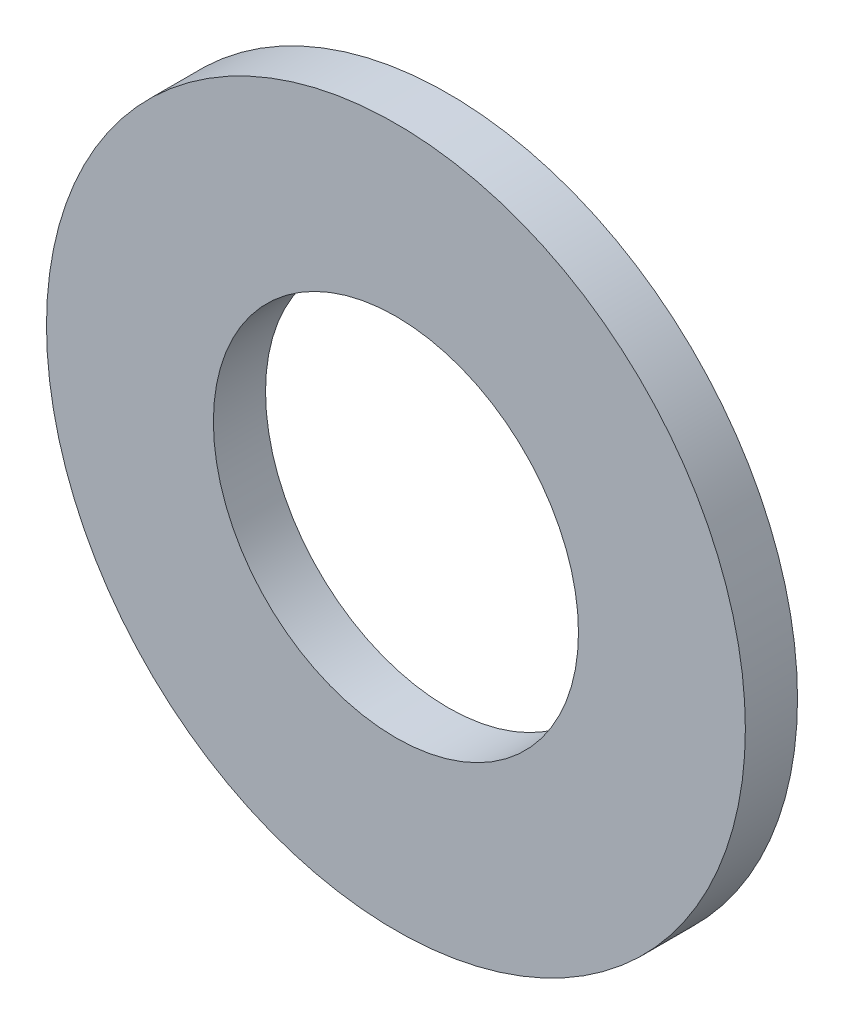
ISO-10303-21;
HEADER;
FILE_DESCRIPTION(('STEP AP214'),'2;1');
FILE_NAME('part.step','',(''),(''),'','','');
FILE_SCHEMA(('AUTOMOTIVE_DESIGN { 1 0 10303 214 1 1 1 1 }'));
ENDSEC;
DATA;
#1=APPLICATION_CONTEXT('core data for automotive mechanical design processes');
#2=APPLICATION_PROTOCOL_DEFINITION('international standard','automotive_design',2000,#1);
#3=PRODUCT_CONTEXT('',#1,'mechanical');
#4=PRODUCT('Part','Part','',(#3));
#5=PRODUCT_RELATED_PRODUCT_CATEGORY('part','',(#4));
#6=PRODUCT_DEFINITION_FORMATION('','',#4);
#7=PRODUCT_DEFINITION_CONTEXT('part definition',#1,'design');
#8=PRODUCT_DEFINITION('design','',#6,#7);
#9=PRODUCT_DEFINITION_SHAPE('','',#8);
#10=(LENGTH_UNIT() NAMED_UNIT(*) SI_UNIT(.MILLI.,.METRE.));
#11=(NAMED_UNIT(*) PLANE_ANGLE_UNIT() SI_UNIT($,.RADIAN.));
#12=(NAMED_UNIT(*) SI_UNIT($,.STERADIAN.) SOLID_ANGLE_UNIT());
#13=UNCERTAINTY_MEASURE_WITH_UNIT(LENGTH_MEASURE(1.E-05),#10,'distance_accuracy_value','');
#14=(GEOMETRIC_REPRESENTATION_CONTEXT(3) GLOBAL_UNCERTAINTY_ASSIGNED_CONTEXT((#13)) GLOBAL_UNIT_ASSIGNED_CONTEXT((#10,
#11,#12)) REPRESENTATION_CONTEXT('',''));
#15=CARTESIAN_POINT('',(0.,0.,0.));
#16=DIRECTION('',(0.,0.,1.));
#17=DIRECTION('',(1.,0.,0.));
#18=AXIS2_PLACEMENT_3D('',#15,#16,#17);
#19=CARTESIAN_POINT('',(0.,0.,0.));
#20=DIRECTION('',(0.,0.,1.));
#21=DIRECTION('',(1.,0.,0.));
#22=AXIS2_PLACEMENT_3D('',#19,#20,#21);
#23=PLANE('',#22);
#24=CARTESIAN_POINT('',(0.,0.,0.));
#25=DIRECTION('',(0.,0.,1.));
#26=DIRECTION('',(1.,0.,0.));
#27=AXIS2_PLACEMENT_3D('',#24,#25,#26);
#28=CIRCLE('',#27,1.75);
#29=CARTESIAN_POINT('',(1.75,0.,0.));
#30=VERTEX_POINT('',#29);
#31=EDGE_CURVE('E26',#30,#30,#28,.T.);
#32=ORIENTED_EDGE('',*,*,#31,.T.);
#33=EDGE_LOOP('',(#32));
#34=FACE_BOUND('',#33,.T.);
#35=CARTESIAN_POINT('',(0.,0.,0.));
#36=DIRECTION('',(0.,0.,1.));
#37=DIRECTION('',(1.,0.,0.));
#38=AXIS2_PLACEMENT_3D('',#35,#36,#37);
#39=CIRCLE('',#38,3.35);
#40=CARTESIAN_POINT('',(3.35,0.,0.));
#41=VERTEX_POINT('',#40);
#42=EDGE_CURVE('E17',#41,#41,#39,.T.);
#43=ORIENTED_EDGE('',*,*,#42,.F.);
#44=EDGE_LOOP('',(#43));
#45=FACE_BOUND('',#44,.T.);
#46=ADVANCED_FACE('F14',(#34,#45),#23,.F.);
#47=CARTESIAN_POINT('',(0.,0.,0.));
#48=DIRECTION('',(0.,0.,1.));
#49=DIRECTION('',(1.,0.,0.));
#50=AXIS2_PLACEMENT_3D('',#47,#48,#49);
#51=CYLINDRICAL_SURFACE('',#50,3.35);
#52=ORIENTED_EDGE('',*,*,#42,.T.);
#53=EDGE_LOOP('',(#52));
#54=FACE_BOUND('',#53,.T.);
#55=CARTESIAN_POINT('',(0.,0.,0.5));
#56=DIRECTION('',(0.,0.,1.));
#57=DIRECTION('',(1.,0.,0.));
#58=AXIS2_PLACEMENT_3D('',#55,#56,#57);
#59=CIRCLE('',#58,3.35);
#60=CARTESIAN_POINT('',(3.35,0.,0.5));
#61=VERTEX_POINT('',#60);
#62=EDGE_CURVE('E21',#61,#61,#59,.T.);
#63=ORIENTED_EDGE('',*,*,#62,.F.);
#64=EDGE_LOOP('',(#63));
#65=FACE_BOUND('',#64,.T.);
#66=ADVANCED_FACE('F34',(#54,#65),#51,.T.);
#67=CARTESIAN_POINT('',(0.,0.,0.));
#68=DIRECTION('',(0.,0.,1.));
#69=DIRECTION('',(1.,0.,0.));
#70=AXIS2_PLACEMENT_3D('',#67,#68,#69);
#71=CYLINDRICAL_SURFACE('',#70,1.75);
#72=ORIENTED_EDGE('',*,*,#31,.F.);
#73=EDGE_LOOP('',(#72));
#74=FACE_BOUND('',#73,.T.);
#75=CARTESIAN_POINT('',(0.,0.,0.5));
#76=DIRECTION('',(0.,0.,1.));
#77=DIRECTION('',(1.,0.,0.));
#78=AXIS2_PLACEMENT_3D('',#75,#76,#77);
#79=CIRCLE('',#78,1.75);
#80=CARTESIAN_POINT('',(1.75,0.,0.5));
#81=VERTEX_POINT('',#80);
#82=EDGE_CURVE('E10',#81,#81,#79,.F.);
#83=ORIENTED_EDGE('',*,*,#82,.F.);
#84=EDGE_LOOP('',(#83));
#85=FACE_BOUND('',#84,.T.);
#86=ADVANCED_FACE('F42',(#74,#85),#71,.F.);
#87=CARTESIAN_POINT('',(0.,0.,0.5));
#88=DIRECTION('',(0.,0.,1.));
#89=DIRECTION('',(1.,0.,0.));
#90=AXIS2_PLACEMENT_3D('',#87,#88,#89);
#91=PLANE('',#90);
#92=ORIENTED_EDGE('',*,*,#82,.T.);
#93=EDGE_LOOP('',(#92));
#94=FACE_BOUND('',#93,.T.);
#95=ORIENTED_EDGE('',*,*,#62,.T.);
#96=EDGE_LOOP('',(#95));
#97=FACE_BOUND('',#96,.T.);
#98=ADVANCED_FACE('F43',(#94,#97),#91,.T.);
#99=CLOSED_SHELL('',(#46,#66,#86,#98));
#100=MANIFOLD_SOLID_BREP('B1',#99);
#101=ADVANCED_BREP_SHAPE_REPRESENTATION('',(#18,#100),#14);
#102=SHAPE_DEFINITION_REPRESENTATION(#9,#101);
ENDSEC;
END-ISO-10303-21;
